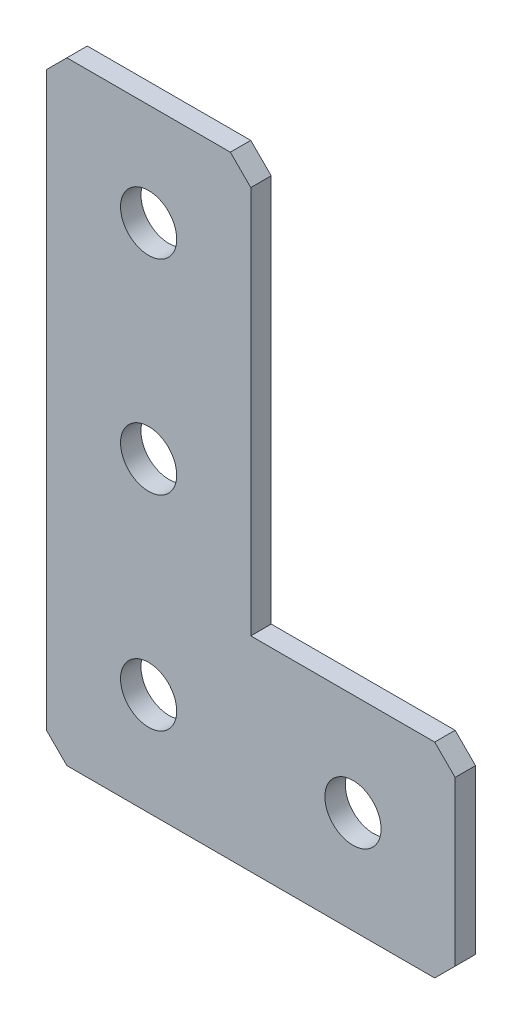
ISO-10303-21;
HEADER;
FILE_DESCRIPTION(('STEP AP214'),'2;1');
FILE_NAME('part.step','',(''),(''),'','','');
FILE_SCHEMA(('AUTOMOTIVE_DESIGN { 1 0 10303 214 1 1 1 1 }'));
ENDSEC;
DATA;
#1=APPLICATION_CONTEXT('core data for automotive mechanical design processes');
#2=APPLICATION_PROTOCOL_DEFINITION('international standard','automotive_design',2000,#1);
#3=PRODUCT_CONTEXT('',#1,'mechanical');
#4=PRODUCT('Part','Part','',(#3));
#5=PRODUCT_RELATED_PRODUCT_CATEGORY('part','',(#4));
#6=PRODUCT_DEFINITION_FORMATION('','',#4);
#7=PRODUCT_DEFINITION_CONTEXT('part definition',#1,'design');
#8=PRODUCT_DEFINITION('design','',#6,#7);
#9=PRODUCT_DEFINITION_SHAPE('','',#8);
#10=(LENGTH_UNIT() NAMED_UNIT(*) SI_UNIT(.MILLI.,.METRE.));
#11=(NAMED_UNIT(*) PLANE_ANGLE_UNIT() SI_UNIT($,.RADIAN.));
#12=(NAMED_UNIT(*) SI_UNIT($,.STERADIAN.) SOLID_ANGLE_UNIT());
#13=UNCERTAINTY_MEASURE_WITH_UNIT(LENGTH_MEASURE(1.E-05),#10,'distance_accuracy_value','');
#14=(GEOMETRIC_REPRESENTATION_CONTEXT(3) GLOBAL_UNCERTAINTY_ASSIGNED_CONTEXT((#13)) GLOBAL_UNIT_ASSIGNED_CONTEXT((#10,
#11,#12)) REPRESENTATION_CONTEXT('',''));
#15=CARTESIAN_POINT('',(0.,0.,0.));
#16=DIRECTION('',(0.,0.,1.));
#17=DIRECTION('',(1.,0.,0.));
#18=AXIS2_PLACEMENT_3D('',#15,#16,#17);
#19=CARTESIAN_POINT('',(20.,0.,-2.));
#20=DIRECTION('',(0.,-1.,0.));
#21=DIRECTION('',(1.,0.,0.));
#22=AXIS2_PLACEMENT_3D('',#19,#20,#21);
#23=PLANE('',#22);
#24=DIRECTION('',(1.,0.,0.));
#25=VECTOR('',#24,1.);
#26=CARTESIAN_POINT('',(20.,0.,-2.));
#27=LINE('',#26,#25);
#28=CARTESIAN_POINT('',(2.00000000000001,0.,-2.));
#29=VERTEX_POINT('',#28);
#30=CARTESIAN_POINT('',(18.,0.,-2.));
#31=VERTEX_POINT('',#30);
#32=EDGE_CURVE('E143',#29,#31,#27,.T.);
#33=ORIENTED_EDGE('',*,*,#32,.F.);
#34=DIRECTION('',(0.,0.,1.));
#35=VECTOR('',#34,1.);
#36=CARTESIAN_POINT('',(2.00000000000001,0.,-2.));
#37=LINE('',#36,#35);
#38=CARTESIAN_POINT('',(2.00000000000001,0.,0.));
#39=VERTEX_POINT('',#38);
#40=EDGE_CURVE('E197',#29,#39,#37,.T.);
#41=ORIENTED_EDGE('',*,*,#40,.T.);
#42=DIRECTION('',(1.,0.,0.));
#43=VECTOR('',#42,1.);
#44=CARTESIAN_POINT('',(20.,0.,0.));
#45=LINE('',#44,#43);
#46=CARTESIAN_POINT('',(18.,0.,0.));
#47=VERTEX_POINT('',#46);
#48=EDGE_CURVE('E174',#39,#47,#45,.T.);
#49=ORIENTED_EDGE('',*,*,#48,.T.);
#50=DIRECTION('',(0.,0.,-1.));
#51=VECTOR('',#50,1.);
#52=CARTESIAN_POINT('',(18.,0.,-2.));
#53=LINE('',#52,#51);
#54=EDGE_CURVE('E154',#47,#31,#53,.T.);
#55=ORIENTED_EDGE('',*,*,#54,.T.);
#56=EDGE_LOOP('',(#33,#41,#49,#55));
#57=FACE_BOUND('',#56,.T.);
#58=ADVANCED_FACE('F45',(#57),#23,.F.);
#59=CARTESIAN_POINT('',(20.,-40.,-2.));
#60=DIRECTION('',(-1.,0.,0.));
#61=DIRECTION('',(0.,-1.,0.));
#62=AXIS2_PLACEMENT_3D('',#59,#60,#61);
#63=PLANE('',#62);
#64=DIRECTION('',(0.,-1.,0.));
#65=VECTOR('',#64,1.);
#66=CARTESIAN_POINT('',(20.,-40.,-2.));
#67=LINE('',#66,#65);
#68=CARTESIAN_POINT('',(20.,-1.99999999999999,-2.));
#69=VERTEX_POINT('',#68);
#70=CARTESIAN_POINT('',(20.,-40.,-2.));
#71=VERTEX_POINT('',#70);
#72=EDGE_CURVE('E129',#69,#71,#67,.T.);
#73=ORIENTED_EDGE('',*,*,#72,.F.);
#74=DIRECTION('',(0.,0.,1.));
#75=VECTOR('',#74,1.);
#76=CARTESIAN_POINT('',(20.,-1.99999999999999,-2.));
#77=LINE('',#76,#75);
#78=CARTESIAN_POINT('',(20.,-1.99999999999999,0.));
#79=VERTEX_POINT('',#78);
#80=EDGE_CURVE('E236',#69,#79,#77,.T.);
#81=ORIENTED_EDGE('',*,*,#80,.T.);
#82=DIRECTION('',(0.,-1.,0.));
#83=VECTOR('',#82,1.);
#84=CARTESIAN_POINT('',(20.,-40.,0.));
#85=LINE('',#84,#83);
#86=CARTESIAN_POINT('',(20.,-40.,0.));
#87=VERTEX_POINT('',#86);
#88=EDGE_CURVE('E149',#79,#87,#85,.T.);
#89=ORIENTED_EDGE('',*,*,#88,.T.);
#90=DIRECTION('',(0.,0.,1.));
#91=VECTOR('',#90,1.);
#92=CARTESIAN_POINT('',(20.,-40.,-2.));
#93=LINE('',#92,#91);
#94=EDGE_CURVE('E146',#71,#87,#93,.T.);
#95=ORIENTED_EDGE('',*,*,#94,.F.);
#96=EDGE_LOOP('',(#73,#81,#89,#95));
#97=FACE_BOUND('',#96,.T.);
#98=ADVANCED_FACE('F147',(#97),#63,.F.);
#99=CARTESIAN_POINT('',(40.,-40.,-2.));
#100=DIRECTION('',(0.,-1.,0.));
#101=DIRECTION('',(0.,0.,-1.));
#102=AXIS2_PLACEMENT_3D('',#99,#100,#101);
#103=PLANE('',#102);
#104=DIRECTION('',(1.,0.,0.));
#105=VECTOR('',#104,1.);
#106=CARTESIAN_POINT('',(40.,-40.,0.));
#107=LINE('',#106,#105);
#108=CARTESIAN_POINT('',(38.,-40.,0.));
#109=VERTEX_POINT('',#108);
#110=EDGE_CURVE('E181',#87,#109,#107,.T.);
#111=ORIENTED_EDGE('',*,*,#110,.T.);
#112=DIRECTION('',(0.,0.,-1.));
#113=VECTOR('',#112,1.);
#114=CARTESIAN_POINT('',(38.,-40.,-2.));
#115=LINE('',#114,#113);
#116=CARTESIAN_POINT('',(38.,-40.,-2.));
#117=VERTEX_POINT('',#116);
#118=EDGE_CURVE('E159',#109,#117,#115,.T.);
#119=ORIENTED_EDGE('',*,*,#118,.T.);
#120=DIRECTION('',(1.,0.,0.));
#121=VECTOR('',#120,1.);
#122=CARTESIAN_POINT('',(40.,-40.,-2.));
#123=LINE('',#122,#121);
#124=EDGE_CURVE('E134',#71,#117,#123,.T.);
#125=ORIENTED_EDGE('',*,*,#124,.F.);
#126=ORIENTED_EDGE('',*,*,#94,.T.);
#127=EDGE_LOOP('',(#111,#119,#125,#126));
#128=FACE_BOUND('',#127,.T.);
#129=ADVANCED_FACE('F157',(#128),#103,.F.);
#130=CARTESIAN_POINT('',(40.,-60.,-2.));
#131=DIRECTION('',(-1.,0.,0.));
#132=DIRECTION('',(0.,0.,1.));
#133=AXIS2_PLACEMENT_3D('',#130,#131,#132);
#134=PLANE('',#133);
#135=DIRECTION('',(0.,-1.,0.));
#136=VECTOR('',#135,1.);
#137=CARTESIAN_POINT('',(40.,-60.,-2.));
#138=LINE('',#137,#136);
#139=CARTESIAN_POINT('',(40.,-42.,-2.));
#140=VERTEX_POINT('',#139);
#141=CARTESIAN_POINT('',(40.,-58.,-2.));
#142=VERTEX_POINT('',#141);
#143=EDGE_CURVE('E161',#140,#142,#138,.T.);
#144=ORIENTED_EDGE('',*,*,#143,.F.);
#145=DIRECTION('',(0.,0.,1.));
#146=VECTOR('',#145,1.);
#147=CARTESIAN_POINT('',(40.,-42.,-2.));
#148=LINE('',#147,#146);
#149=CARTESIAN_POINT('',(40.,-42.,0.));
#150=VERTEX_POINT('',#149);
#151=EDGE_CURVE('E242',#140,#150,#148,.T.);
#152=ORIENTED_EDGE('',*,*,#151,.T.);
#153=DIRECTION('',(0.,-1.,0.));
#154=VECTOR('',#153,1.);
#155=CARTESIAN_POINT('',(40.,-60.,0.));
#156=LINE('',#155,#154);
#157=CARTESIAN_POINT('',(40.,-58.,0.));
#158=VERTEX_POINT('',#157);
#159=EDGE_CURVE('E184',#150,#158,#156,.T.);
#160=ORIENTED_EDGE('',*,*,#159,.T.);
#161=DIRECTION('',(0.,0.,-1.));
#162=VECTOR('',#161,1.);
#163=CARTESIAN_POINT('',(40.,-58.,-2.));
#164=LINE('',#163,#162);
#165=EDGE_CURVE('E239',#158,#142,#164,.T.);
#166=ORIENTED_EDGE('',*,*,#165,.T.);
#167=EDGE_LOOP('',(#144,#152,#160,#166));
#168=FACE_BOUND('',#167,.T.);
#169=ADVANCED_FACE('F437',(#168),#134,.F.);
#170=CARTESIAN_POINT('',(0.,-60.,-2.));
#171=DIRECTION('',(0.,1.,0.));
#172=DIRECTION('',(0.,0.,1.));
#173=AXIS2_PLACEMENT_3D('',#170,#171,#172);
#174=PLANE('',#173);
#175=DIRECTION('',(-1.,0.,0.));
#176=VECTOR('',#175,1.);
#177=CARTESIAN_POINT('',(0.,-60.,-2.));
#178=LINE('',#177,#176);
#179=CARTESIAN_POINT('',(38.,-60.,-2.));
#180=VERTEX_POINT('',#179);
#181=CARTESIAN_POINT('',(2.00000000000001,-60.,-2.));
#182=VERTEX_POINT('',#181);
#183=EDGE_CURVE('E166',#180,#182,#178,.T.);
#184=ORIENTED_EDGE('',*,*,#183,.F.);
#185=DIRECTION('',(0.,0.,1.));
#186=VECTOR('',#185,1.);
#187=CARTESIAN_POINT('',(38.,-60.,-2.));
#188=LINE('',#187,#186);
#189=CARTESIAN_POINT('',(38.,-60.,0.));
#190=VERTEX_POINT('',#189);
#191=EDGE_CURVE('E11',#180,#190,#188,.T.);
#192=ORIENTED_EDGE('',*,*,#191,.T.);
#193=DIRECTION('',(-1.,0.,0.));
#194=VECTOR('',#193,1.);
#195=CARTESIAN_POINT('',(0.,-60.,0.));
#196=LINE('',#195,#194);
#197=CARTESIAN_POINT('',(2.00000000000001,-60.,0.));
#198=VERTEX_POINT('',#197);
#199=EDGE_CURVE('E188',#190,#198,#196,.T.);
#200=ORIENTED_EDGE('',*,*,#199,.T.);
#201=DIRECTION('',(0.,0.,-1.));
#202=VECTOR('',#201,1.);
#203=CARTESIAN_POINT('',(2.00000000000001,-60.,-2.));
#204=LINE('',#203,#202);
#205=EDGE_CURVE('E54',#198,#182,#204,.T.);
#206=ORIENTED_EDGE('',*,*,#205,.T.);
#207=EDGE_LOOP('',(#184,#192,#200,#206));
#208=FACE_BOUND('',#207,.T.);
#209=ADVANCED_FACE('F421',(#208),#174,.F.);
#210=CARTESIAN_POINT('',(0.,0.,-2.));
#211=DIRECTION('',(1.,0.,0.));
#212=DIRECTION('',(0.,0.,-1.));
#213=AXIS2_PLACEMENT_3D('',#210,#211,#212);
#214=PLANE('',#213);
#215=DIRECTION('',(0.,1.,0.));
#216=VECTOR('',#215,1.);
#217=CARTESIAN_POINT('',(0.,0.,0.));
#218=LINE('',#217,#216);
#219=CARTESIAN_POINT('',(0.,-58.,0.));
#220=VERTEX_POINT('',#219);
#221=CARTESIAN_POINT('',(0.,-2.00000000000002,0.));
#222=VERTEX_POINT('',#221);
#223=EDGE_CURVE('E191',#220,#222,#218,.T.);
#224=ORIENTED_EDGE('',*,*,#223,.T.);
#225=DIRECTION('',(0.,0.,-1.));
#226=VECTOR('',#225,1.);
#227=CARTESIAN_POINT('',(0.,-2.00000000000002,-2.));
#228=LINE('',#227,#226);
#229=CARTESIAN_POINT('',(0.,-2.00000000000002,-2.));
#230=VERTEX_POINT('',#229);
#231=EDGE_CURVE('E220',#222,#230,#228,.T.);
#232=ORIENTED_EDGE('',*,*,#231,.T.);
#233=DIRECTION('',(0.,1.,0.));
#234=VECTOR('',#233,1.);
#235=CARTESIAN_POINT('',(0.,0.,-2.));
#236=LINE('',#235,#234);
#237=CARTESIAN_POINT('',(0.,-58.,-2.));
#238=VERTEX_POINT('',#237);
#239=EDGE_CURVE('E155',#238,#230,#236,.T.);
#240=ORIENTED_EDGE('',*,*,#239,.F.);
#241=DIRECTION('',(0.,0.,1.));
#242=VECTOR('',#241,1.);
#243=CARTESIAN_POINT('',(0.,-58.,-2.));
#244=LINE('',#243,#242);
#245=EDGE_CURVE('E216',#238,#220,#244,.T.);
#246=ORIENTED_EDGE('',*,*,#245,.T.);
#247=EDGE_LOOP('',(#224,#232,#240,#246));
#248=FACE_BOUND('',#247,.T.);
#249=ADVANCED_FACE('F367',(#248),#214,.F.);
#250=CARTESIAN_POINT('',(0.,0.,-2.));
#251=DIRECTION('',(0.,0.,1.));
#252=DIRECTION('',(1.,0.,0.));
#253=AXIS2_PLACEMENT_3D('',#250,#251,#252);
#254=PLANE('',#253);
#255=CARTESIAN_POINT('',(30.,-50.,-2.));
#256=DIRECTION('',(0.,0.,-1.));
#257=DIRECTION('',(0.,1.,0.));
#258=AXIS2_PLACEMENT_3D('',#255,#256,#257);
#259=CIRCLE('',#258,2.75);
#260=CARTESIAN_POINT('',(30.,-47.25,-2.));
#261=VERTEX_POINT('',#260);
#262=EDGE_CURVE('E355',#261,#261,#259,.T.);
#263=ORIENTED_EDGE('',*,*,#262,.F.);
#264=EDGE_LOOP('',(#263));
#265=FACE_BOUND('',#264,.T.);
#266=CARTESIAN_POINT('',(10.,-50.,-2.));
#267=DIRECTION('',(0.,0.,-1.));
#268=DIRECTION('',(0.,1.,0.));
#269=AXIS2_PLACEMENT_3D('',#266,#267,#268);
#270=CIRCLE('',#269,2.75);
#271=CARTESIAN_POINT('',(10.,-47.25,-2.));
#272=VERTEX_POINT('',#271);
#273=EDGE_CURVE('E345',#272,#272,#270,.T.);
#274=ORIENTED_EDGE('',*,*,#273,.F.);
#275=EDGE_LOOP('',(#274));
#276=FACE_BOUND('',#275,.T.);
#277=CARTESIAN_POINT('',(10.,-30.,-2.));
#278=DIRECTION('',(0.,0.,-1.));
#279=DIRECTION('',(0.,1.,0.));
#280=AXIS2_PLACEMENT_3D('',#277,#278,#279);
#281=CIRCLE('',#280,2.75);
#282=CARTESIAN_POINT('',(10.,-27.25,-2.));
#283=VERTEX_POINT('',#282);
#284=EDGE_CURVE('E335',#283,#283,#281,.T.);
#285=ORIENTED_EDGE('',*,*,#284,.F.);
#286=EDGE_LOOP('',(#285));
#287=FACE_BOUND('',#286,.T.);
#288=CARTESIAN_POINT('',(10.,-9.99999999999999,-2.));
#289=DIRECTION('',(0.,0.,-1.));
#290=DIRECTION('',(0.,1.,0.));
#291=AXIS2_PLACEMENT_3D('',#288,#289,#290);
#292=CIRCLE('',#291,2.75);
#293=CARTESIAN_POINT('',(10.,-7.24999999999999,-2.));
#294=VERTEX_POINT('',#293);
#295=EDGE_CURVE('E325',#294,#294,#292,.T.);
#296=ORIENTED_EDGE('',*,*,#295,.F.);
#297=EDGE_LOOP('',(#296));
#298=FACE_BOUND('',#297,.T.);
#299=ORIENTED_EDGE('',*,*,#239,.T.);
#300=DIRECTION('',(-0.707106781186546,-0.707106781186549,0.));
#301=VECTOR('',#300,1.);
#302=CARTESIAN_POINT('',(2.00000000000001,0.,-2.));
#303=LINE('',#302,#301);
#304=EDGE_CURVE('E233',#230,#29,#303,.F.);
#305=ORIENTED_EDGE('',*,*,#304,.T.);
#306=ORIENTED_EDGE('',*,*,#32,.T.);
#307=DIRECTION('',(-0.70710678118655,0.707106781186545,0.));
#308=VECTOR('',#307,1.);
#309=CARTESIAN_POINT('',(20.,-1.99999999999999,-2.));
#310=LINE('',#309,#308);
#311=EDGE_CURVE('E138',#31,#69,#310,.F.);
#312=ORIENTED_EDGE('',*,*,#311,.T.);
#313=ORIENTED_EDGE('',*,*,#72,.T.);
#314=ORIENTED_EDGE('',*,*,#124,.T.);
#315=DIRECTION('',(-0.70710678118655,0.707106781186545,0.));
#316=VECTOR('',#315,1.);
#317=CARTESIAN_POINT('',(40.,-42.,-2.));
#318=LINE('',#317,#316);
#319=EDGE_CURVE('E228',#117,#140,#318,.F.);
#320=ORIENTED_EDGE('',*,*,#319,.T.);
#321=ORIENTED_EDGE('',*,*,#143,.T.);
#322=DIRECTION('',(0.707106781186545,0.70710678118655,0.));
#323=VECTOR('',#322,1.);
#324=CARTESIAN_POINT('',(38.,-60.,-2.));
#325=LINE('',#324,#323);
#326=EDGE_CURVE('E67',#142,#180,#325,.F.);
#327=ORIENTED_EDGE('',*,*,#326,.T.);
#328=ORIENTED_EDGE('',*,*,#183,.T.);
#329=DIRECTION('',(0.70710678118655,-0.707106781186545,0.));
#330=VECTOR('',#329,1.);
#331=CARTESIAN_POINT('',(0.,-58.,-2.));
#332=LINE('',#331,#330);
#333=EDGE_CURVE('E223',#182,#238,#332,.F.);
#334=ORIENTED_EDGE('',*,*,#333,.T.);
#335=EDGE_LOOP('',(#299,#305,#306,#312,#313,#314,#320,#321,#327,#328,#334));
#336=FACE_BOUND('',#335,.T.);
#337=ADVANCED_FACE('F132',(#265,#276,#287,#298,#336),#254,.F.);
#338=CARTESIAN_POINT('',(0.,0.,0.));
#339=DIRECTION('',(0.,0.,1.));
#340=DIRECTION('',(1.,0.,0.));
#341=AXIS2_PLACEMENT_3D('',#338,#339,#340);
#342=PLANE('',#341);
#343=CARTESIAN_POINT('',(30.,-50.,0.));
#344=DIRECTION('',(0.,0.,-1.));
#345=DIRECTION('',(0.,1.,0.));
#346=AXIS2_PLACEMENT_3D('',#343,#344,#345);
#347=CIRCLE('',#346,2.75);
#348=CARTESIAN_POINT('',(30.,-47.25,0.));
#349=VERTEX_POINT('',#348);
#350=EDGE_CURVE('E350',#349,#349,#347,.T.);
#351=ORIENTED_EDGE('',*,*,#350,.T.);
#352=EDGE_LOOP('',(#351));
#353=FACE_BOUND('',#352,.T.);
#354=CARTESIAN_POINT('',(10.,-50.,0.));
#355=DIRECTION('',(0.,0.,-1.));
#356=DIRECTION('',(0.,1.,0.));
#357=AXIS2_PLACEMENT_3D('',#354,#355,#356);
#358=CIRCLE('',#357,2.75);
#359=CARTESIAN_POINT('',(10.,-47.25,0.));
#360=VERTEX_POINT('',#359);
#361=EDGE_CURVE('E340',#360,#360,#358,.T.);
#362=ORIENTED_EDGE('',*,*,#361,.T.);
#363=EDGE_LOOP('',(#362));
#364=FACE_BOUND('',#363,.T.);
#365=CARTESIAN_POINT('',(10.,-30.,0.));
#366=DIRECTION('',(0.,0.,-1.));
#367=DIRECTION('',(0.,1.,0.));
#368=AXIS2_PLACEMENT_3D('',#365,#366,#367);
#369=CIRCLE('',#368,2.75);
#370=CARTESIAN_POINT('',(10.,-27.25,0.));
#371=VERTEX_POINT('',#370);
#372=EDGE_CURVE('E330',#371,#371,#369,.T.);
#373=ORIENTED_EDGE('',*,*,#372,.T.);
#374=EDGE_LOOP('',(#373));
#375=FACE_BOUND('',#374,.T.);
#376=CARTESIAN_POINT('',(10.,-9.99999999999999,0.));
#377=DIRECTION('',(0.,0.,-1.));
#378=DIRECTION('',(0.,1.,0.));
#379=AXIS2_PLACEMENT_3D('',#376,#377,#378);
#380=CIRCLE('',#379,2.75);
#381=CARTESIAN_POINT('',(10.,-7.25,0.));
#382=VERTEX_POINT('',#381);
#383=EDGE_CURVE('E178',#382,#382,#380,.T.);
#384=ORIENTED_EDGE('',*,*,#383,.T.);
#385=EDGE_LOOP('',(#384));
#386=FACE_BOUND('',#385,.T.);
#387=ORIENTED_EDGE('',*,*,#48,.F.);
#388=DIRECTION('',(0.707106781186546,0.707106781186549,0.));
#389=VECTOR('',#388,1.);
#390=CARTESIAN_POINT('',(1.00000000000001,-1.,0.));
#391=LINE('',#390,#389);
#392=EDGE_CURVE('E213',#39,#222,#391,.F.);
#393=ORIENTED_EDGE('',*,*,#392,.T.);
#394=ORIENTED_EDGE('',*,*,#223,.F.);
#395=DIRECTION('',(-0.70710678118655,0.707106781186545,0.));
#396=VECTOR('',#395,1.);
#397=CARTESIAN_POINT('',(-29.,-29.0000000000002,0.));
#398=LINE('',#397,#396);
#399=EDGE_CURVE('E201',#220,#198,#398,.F.);
#400=ORIENTED_EDGE('',*,*,#399,.T.);
#401=ORIENTED_EDGE('',*,*,#199,.F.);
#402=DIRECTION('',(-0.707106781186545,-0.70710678118655,0.));
#403=VECTOR('',#402,1.);
#404=CARTESIAN_POINT('',(49.0000000000001,-48.9999999999998,0.));
#405=LINE('',#404,#403);
#406=EDGE_CURVE('E204',#190,#158,#405,.F.);
#407=ORIENTED_EDGE('',*,*,#406,.T.);
#408=ORIENTED_EDGE('',*,*,#159,.F.);
#409=DIRECTION('',(0.70710678118655,-0.707106781186545,0.));
#410=VECTOR('',#409,1.);
#411=CARTESIAN_POINT('',(-1.00000000000014,-1.00000000000014,0.));
#412=LINE('',#411,#410);
#413=EDGE_CURVE('E207',#150,#109,#412,.F.);
#414=ORIENTED_EDGE('',*,*,#413,.T.);
#415=ORIENTED_EDGE('',*,*,#110,.F.);
#416=ORIENTED_EDGE('',*,*,#88,.F.);
#417=DIRECTION('',(0.70710678118655,-0.707106781186545,0.));
#418=VECTOR('',#417,1.);
#419=CARTESIAN_POINT('',(8.99999999999993,9.,0.));
#420=LINE('',#419,#418);
#421=EDGE_CURVE('E210',#79,#47,#420,.F.);
#422=ORIENTED_EDGE('',*,*,#421,.T.);
#423=EDGE_LOOP('',(#387,#393,#394,#400,#401,#407,#408,#414,#415,#416,#422));
#424=FACE_BOUND('',#423,.T.);
#425=ADVANCED_FACE('F366',(#353,#364,#375,#386,#424),#342,.T.);
#426=CARTESIAN_POINT('',(10.,-9.99999999999999,-2.));
#427=DIRECTION('',(0.,0.,-1.));
#428=DIRECTION('',(0.,1.,0.));
#429=AXIS2_PLACEMENT_3D('',#426,#427,#428);
#430=CYLINDRICAL_SURFACE('',#429,2.75);
#431=ORIENTED_EDGE('',*,*,#383,.F.);
#432=EDGE_LOOP('',(#431));
#433=FACE_BOUND('',#432,.T.);
#434=ORIENTED_EDGE('',*,*,#295,.T.);
#435=EDGE_LOOP('',(#434));
#436=FACE_BOUND('',#435,.T.);
#437=ADVANCED_FACE('F375',(#433,#436),#430,.F.);
#438=CARTESIAN_POINT('',(10.,-30.,-2.));
#439=DIRECTION('',(0.,0.,-1.));
#440=DIRECTION('',(0.,1.,0.));
#441=AXIS2_PLACEMENT_3D('',#438,#439,#440);
#442=CYLINDRICAL_SURFACE('',#441,2.75);
#443=ORIENTED_EDGE('',*,*,#372,.F.);
#444=EDGE_LOOP('',(#443));
#445=FACE_BOUND('',#444,.T.);
#446=ORIENTED_EDGE('',*,*,#284,.T.);
#447=EDGE_LOOP('',(#446));
#448=FACE_BOUND('',#447,.T.);
#449=ADVANCED_FACE('F377',(#445,#448),#442,.F.);
#450=CARTESIAN_POINT('',(10.,-50.,-2.));
#451=DIRECTION('',(0.,0.,-1.));
#452=DIRECTION('',(0.,1.,0.));
#453=AXIS2_PLACEMENT_3D('',#450,#451,#452);
#454=CYLINDRICAL_SURFACE('',#453,2.75);
#455=ORIENTED_EDGE('',*,*,#361,.F.);
#456=EDGE_LOOP('',(#455));
#457=FACE_BOUND('',#456,.T.);
#458=ORIENTED_EDGE('',*,*,#273,.T.);
#459=EDGE_LOOP('',(#458));
#460=FACE_BOUND('',#459,.T.);
#461=ADVANCED_FACE('F384',(#457,#460),#454,.F.);
#462=CARTESIAN_POINT('',(30.,-50.,-2.));
#463=DIRECTION('',(0.,0.,-1.));
#464=DIRECTION('',(0.,1.,0.));
#465=AXIS2_PLACEMENT_3D('',#462,#463,#464);
#466=CYLINDRICAL_SURFACE('',#465,2.75);
#467=ORIENTED_EDGE('',*,*,#350,.F.);
#468=EDGE_LOOP('',(#467));
#469=FACE_BOUND('',#468,.T.);
#470=ORIENTED_EDGE('',*,*,#262,.T.);
#471=EDGE_LOOP('',(#470));
#472=FACE_BOUND('',#471,.T.);
#473=ADVANCED_FACE('F362',(#469,#472),#466,.F.);
#474=CARTESIAN_POINT('',(2.00000000000001,0.,-2.));
#475=DIRECTION('',(0.707106781186549,-0.707106781186546,0.));
#476=DIRECTION('',(0.,0.,1.));
#477=AXIS2_PLACEMENT_3D('',#474,#475,#476);
#478=PLANE('',#477);
#479=ORIENTED_EDGE('',*,*,#304,.F.);
#480=ORIENTED_EDGE('',*,*,#231,.F.);
#481=ORIENTED_EDGE('',*,*,#392,.F.);
#482=ORIENTED_EDGE('',*,*,#40,.F.);
#483=EDGE_LOOP('',(#479,#480,#481,#482));
#484=FACE_BOUND('',#483,.T.);
#485=ADVANCED_FACE('F400',(#484),#478,.F.);
#486=CARTESIAN_POINT('',(20.,-1.99999999999999,-2.));
#487=DIRECTION('',(-0.707106781186545,-0.70710678118655,0.));
#488=DIRECTION('',(0.,0.,1.));
#489=AXIS2_PLACEMENT_3D('',#486,#487,#488);
#490=PLANE('',#489);
#491=ORIENTED_EDGE('',*,*,#311,.F.);
#492=ORIENTED_EDGE('',*,*,#54,.F.);
#493=ORIENTED_EDGE('',*,*,#421,.F.);
#494=ORIENTED_EDGE('',*,*,#80,.F.);
#495=EDGE_LOOP('',(#491,#492,#493,#494));
#496=FACE_BOUND('',#495,.T.);
#497=ADVANCED_FACE('F403',(#496),#490,.F.);
#498=CARTESIAN_POINT('',(40.,-42.,-2.));
#499=DIRECTION('',(-0.707106781186545,-0.70710678118655,0.));
#500=DIRECTION('',(0.,0.,1.));
#501=AXIS2_PLACEMENT_3D('',#498,#499,#500);
#502=PLANE('',#501);
#503=ORIENTED_EDGE('',*,*,#319,.F.);
#504=ORIENTED_EDGE('',*,*,#118,.F.);
#505=ORIENTED_EDGE('',*,*,#413,.F.);
#506=ORIENTED_EDGE('',*,*,#151,.F.);
#507=EDGE_LOOP('',(#503,#504,#505,#506));
#508=FACE_BOUND('',#507,.T.);
#509=ADVANCED_FACE('F407',(#508),#502,.F.);
#510=CARTESIAN_POINT('',(38.,-60.,-2.));
#511=DIRECTION('',(-0.70710678118655,0.707106781186545,0.));
#512=DIRECTION('',(0.,0.,1.));
#513=AXIS2_PLACEMENT_3D('',#510,#511,#512);
#514=PLANE('',#513);
#515=ORIENTED_EDGE('',*,*,#326,.F.);
#516=ORIENTED_EDGE('',*,*,#165,.F.);
#517=ORIENTED_EDGE('',*,*,#406,.F.);
#518=ORIENTED_EDGE('',*,*,#191,.F.);
#519=EDGE_LOOP('',(#515,#516,#517,#518));
#520=FACE_BOUND('',#519,.T.);
#521=ADVANCED_FACE('F410',(#520),#514,.F.);
#522=CARTESIAN_POINT('',(0.,-58.,-2.));
#523=DIRECTION('',(0.707106781186545,0.70710678118655,0.));
#524=DIRECTION('',(0.,0.,1.));
#525=AXIS2_PLACEMENT_3D('',#522,#523,#524);
#526=PLANE('',#525);
#527=ORIENTED_EDGE('',*,*,#333,.F.);
#528=ORIENTED_EDGE('',*,*,#205,.F.);
#529=ORIENTED_EDGE('',*,*,#399,.F.);
#530=ORIENTED_EDGE('',*,*,#245,.F.);
#531=EDGE_LOOP('',(#527,#528,#529,#530));
#532=FACE_BOUND('',#531,.T.);
#533=ADVANCED_FACE('F47',(#532),#526,.F.);
#534=CLOSED_SHELL('',(#58,#98,#129,#169,#209,#249,#337,#425,#437,#449,#461,#473,#485,#497,#509,
#521,#533));
#535=MANIFOLD_SOLID_BREP('B2',#534);
#536=ADVANCED_BREP_SHAPE_REPRESENTATION('',(#18,#535),#14);
#537=SHAPE_DEFINITION_REPRESENTATION(#9,#536);
ENDSEC;
END-ISO-10303-21;
